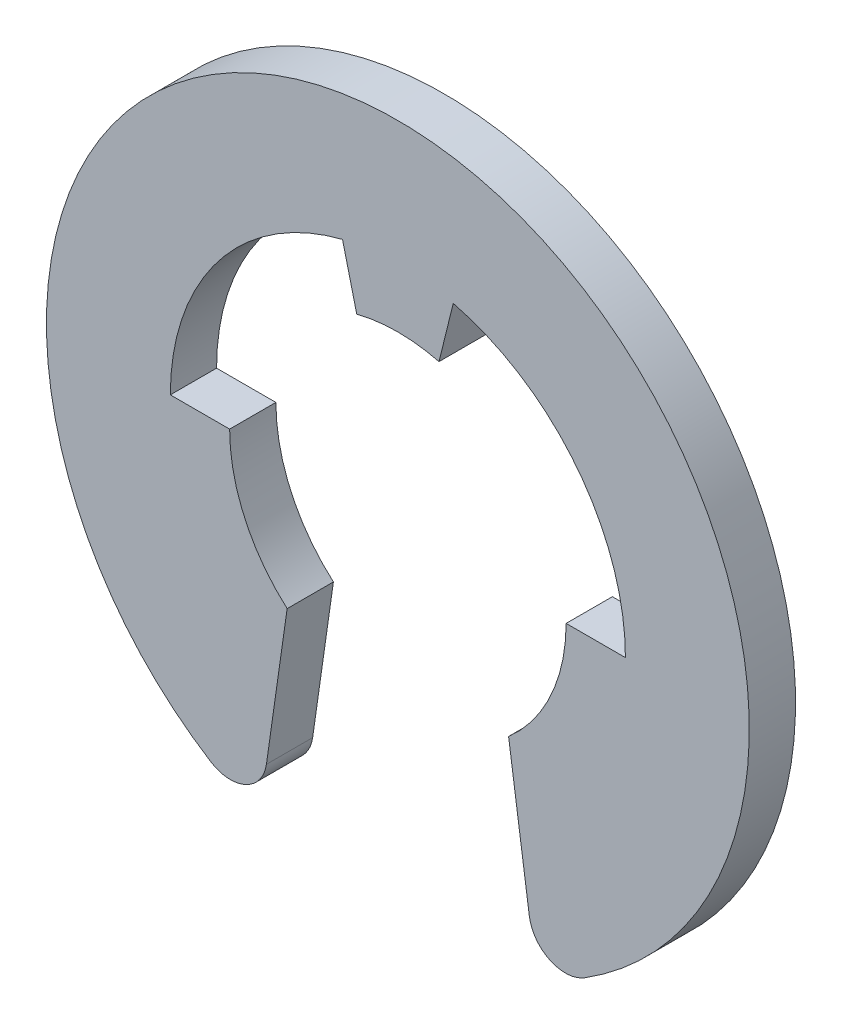
ISO-10303-21;
HEADER;
FILE_DESCRIPTION(('STEP AP214'),'2;1');
FILE_NAME('part.step','',(''),(''),'','','');
FILE_SCHEMA(('AUTOMOTIVE_DESIGN { 1 0 10303 214 1 1 1 1 }'));
ENDSEC;
DATA;
#1=APPLICATION_CONTEXT('core data for automotive mechanical design processes');
#2=APPLICATION_PROTOCOL_DEFINITION('international standard','automotive_design',2000,#1);
#3=PRODUCT_CONTEXT('',#1,'mechanical');
#4=PRODUCT('Part','Part','',(#3));
#5=PRODUCT_RELATED_PRODUCT_CATEGORY('part','',(#4));
#6=PRODUCT_DEFINITION_FORMATION('','',#4);
#7=PRODUCT_DEFINITION_CONTEXT('part definition',#1,'design');
#8=PRODUCT_DEFINITION('design','',#6,#7);
#9=PRODUCT_DEFINITION_SHAPE('','',#8);
#10=(LENGTH_UNIT() NAMED_UNIT(*) SI_UNIT(.MILLI.,.METRE.));
#11=(NAMED_UNIT(*) PLANE_ANGLE_UNIT() SI_UNIT($,.RADIAN.));
#12=(NAMED_UNIT(*) SI_UNIT($,.STERADIAN.) SOLID_ANGLE_UNIT());
#13=UNCERTAINTY_MEASURE_WITH_UNIT(LENGTH_MEASURE(1.E-05),#10,'distance_accuracy_value','');
#14=(GEOMETRIC_REPRESENTATION_CONTEXT(3) GLOBAL_UNCERTAINTY_ASSIGNED_CONTEXT((#13)) GLOBAL_UNIT_ASSIGNED_CONTEXT((#10,
#11,#12)) REPRESENTATION_CONTEXT('',''));
#15=CARTESIAN_POINT('',(0.,0.,0.));
#16=DIRECTION('',(0.,0.,1.));
#17=DIRECTION('',(1.,0.,0.));
#18=AXIS2_PLACEMENT_3D('',#15,#16,#17);
#19=CARTESIAN_POINT('',(0.,0.,0.3175));
#20=DIRECTION('',(0.,0.,-1.));
#21=DIRECTION('',(-1.,0.,0.));
#22=AXIS2_PLACEMENT_3D('',#19,#20,#21);
#23=CYLINDRICAL_SURFACE('',#22,2.31);
#24=CARTESIAN_POINT('',(0.,0.,-0.3175));
#25=DIRECTION('',(0.,0.,-1.));
#26=DIRECTION('',(-1.,0.,0.));
#27=AXIS2_PLACEMENT_3D('',#24,#25,#26);
#28=CIRCLE('',#27,2.31);
#29=CARTESIAN_POINT('',(2.31,0.,-0.3175));
#30=VERTEX_POINT('',#29);
#31=CARTESIAN_POINT('',(1.52,-1.73945393730331,-0.3175));
#32=VERTEX_POINT('',#31);
#33=EDGE_CURVE('E164',#30,#32,#28,.T.);
#34=ORIENTED_EDGE('',*,*,#33,.T.);
#35=DIRECTION('',(0.,0.,-1.));
#36=VECTOR('',#35,1.);
#37=CARTESIAN_POINT('',(1.52,-1.73945393730331,0.3175));
#38=LINE('',#37,#36);
#39=CARTESIAN_POINT('',(1.52,-1.73945393730331,0.3175));
#40=VERTEX_POINT('',#39);
#41=EDGE_CURVE('E11',#40,#32,#38,.T.);
#42=ORIENTED_EDGE('',*,*,#41,.F.);
#43=CARTESIAN_POINT('',(0.,0.,0.3175));
#44=DIRECTION('',(0.,0.,-1.));
#45=DIRECTION('',(-1.,0.,0.));
#46=AXIS2_PLACEMENT_3D('',#43,#44,#45);
#47=CIRCLE('',#46,2.31);
#48=CARTESIAN_POINT('',(2.31,0.,0.3175));
#49=VERTEX_POINT('',#48);
#50=EDGE_CURVE('E190',#49,#40,#47,.T.);
#51=ORIENTED_EDGE('',*,*,#50,.F.);
#52=DIRECTION('',(0.,0.,-1.));
#53=VECTOR('',#52,1.);
#54=CARTESIAN_POINT('',(2.31,0.,0.3175));
#55=LINE('',#54,#53);
#56=EDGE_CURVE('E160',#49,#30,#55,.T.);
#57=ORIENTED_EDGE('',*,*,#56,.T.);
#58=EDGE_LOOP('',(#34,#42,#51,#57));
#59=FACE_BOUND('',#58,.T.);
#60=ADVANCED_FACE('F32',(#59),#23,.F.);
#61=CARTESIAN_POINT('',(1.52,-1.73945393730331,0.3175));
#62=DIRECTION('',(0.989938895863177,0.141495520979269,0.));
#63=DIRECTION('',(-0.141495520979269,0.989938895863177,0.));
#64=AXIS2_PLACEMENT_3D('',#61,#62,#63);
#65=PLANE('',#64);
#66=DIRECTION('',(0.141495520979269,-0.989938895863176,0.));
#67=VECTOR('',#66,1.);
#68=CARTESIAN_POINT('',(1.52,-1.73945393730331,-0.3175));
#69=LINE('',#68,#67);
#70=CARTESIAN_POINT('',(1.805015039701,-3.73349213549719,-0.3175));
#71=VERTEX_POINT('',#70);
#72=EDGE_CURVE('E167',#32,#71,#69,.T.);
#73=ORIENTED_EDGE('',*,*,#72,.T.);
#74=DIRECTION('',(0.,0.,-1.));
#75=VECTOR('',#74,1.);
#76=CARTESIAN_POINT('',(1.805015039701,-3.73349213549719,0.3175));
#77=LINE('',#76,#75);
#78=CARTESIAN_POINT('',(1.805015039701,-3.73349213549719,0.3175));
#79=VERTEX_POINT('',#78);
#80=EDGE_CURVE('E40',#79,#71,#77,.T.);
#81=ORIENTED_EDGE('',*,*,#80,.F.);
#82=DIRECTION('',(0.141495520979269,-0.989938895863176,0.));
#83=VECTOR('',#82,1.);
#84=CARTESIAN_POINT('',(1.52,-1.73945393730331,0.3175));
#85=LINE('',#84,#83);
#86=EDGE_CURVE('E109',#40,#79,#85,.T.);
#87=ORIENTED_EDGE('',*,*,#86,.F.);
#88=ORIENTED_EDGE('',*,*,#41,.T.);
#89=EDGE_LOOP('',(#73,#81,#87,#88));
#90=FACE_BOUND('',#89,.T.);
#91=ADVANCED_FACE('F278',(#90),#65,.F.);
#92=CARTESIAN_POINT('',(2.29998448763259,-3.66274437500755,0.3175));
#93=DIRECTION('',(0.,0.,-1.));
#94=DIRECTION('',(-1.,0.,0.));
#95=AXIS2_PLACEMENT_3D('',#92,#93,#94);
#96=CYLINDRICAL_SURFACE('',#95,0.5);
#97=CARTESIAN_POINT('',(2.29998448763259,-3.66274437500755,-0.3175));
#98=DIRECTION('',(0.,0.,1.));
#99=DIRECTION('',(1.,0.,0.));
#100=AXIS2_PLACEMENT_3D('',#97,#98,#99);
#101=CIRCLE('',#100,0.5);
#102=CARTESIAN_POINT('',(2.56587864805254,-4.08618303107779,-0.3175));
#103=VERTEX_POINT('',#102);
#104=EDGE_CURVE('E169',#71,#103,#101,.T.);
#105=ORIENTED_EDGE('',*,*,#104,.T.);
#106=DIRECTION('',(0.,0.,-1.));
#107=VECTOR('',#106,1.);
#108=CARTESIAN_POINT('',(2.56587864805254,-4.08618303107779,0.3175));
#109=LINE('',#108,#107);
#110=CARTESIAN_POINT('',(2.56587864805254,-4.08618303107779,0.3175));
#111=VERTEX_POINT('',#110);
#112=EDGE_CURVE('E215',#111,#103,#109,.T.);
#113=ORIENTED_EDGE('',*,*,#112,.F.);
#114=CARTESIAN_POINT('',(2.29998448763259,-3.66274437500755,0.3175));
#115=DIRECTION('',(0.,0.,1.));
#116=DIRECTION('',(1.,0.,0.));
#117=AXIS2_PLACEMENT_3D('',#114,#115,#116);
#118=CIRCLE('',#117,0.5);
#119=EDGE_CURVE('E223',#79,#111,#118,.T.);
#120=ORIENTED_EDGE('',*,*,#119,.F.);
#121=ORIENTED_EDGE('',*,*,#80,.T.);
#122=EDGE_LOOP('',(#105,#113,#120,#121));
#123=FACE_BOUND('',#122,.T.);
#124=ADVANCED_FACE('F221',(#123),#96,.T.);
#125=CARTESIAN_POINT('',(0.,0.,0.3175));
#126=DIRECTION('',(0.,0.,-1.));
#127=DIRECTION('',(-1.,0.,0.));
#128=AXIS2_PLACEMENT_3D('',#125,#126,#127);
#129=CYLINDRICAL_SURFACE('',#128,4.825);
#130=CARTESIAN_POINT('',(0.,0.,-0.3175));
#131=DIRECTION('',(0.,0.,1.));
#132=DIRECTION('',(1.,0.,0.));
#133=AXIS2_PLACEMENT_3D('',#130,#131,#132);
#134=CIRCLE('',#133,4.825);
#135=CARTESIAN_POINT('',(-2.56587864805254,-4.08618303107779,-0.3175));
#136=VERTEX_POINT('',#135);
#137=EDGE_CURVE('E171',#103,#136,#134,.T.);
#138=ORIENTED_EDGE('',*,*,#137,.T.);
#139=DIRECTION('',(0.,0.,-1.));
#140=VECTOR('',#139,1.);
#141=CARTESIAN_POINT('',(-2.56587864805254,-4.08618303107779,0.3175));
#142=LINE('',#141,#140);
#143=CARTESIAN_POINT('',(-2.56587864805254,-4.08618303107779,0.3175));
#144=VERTEX_POINT('',#143);
#145=EDGE_CURVE('E212',#144,#136,#142,.T.);
#146=ORIENTED_EDGE('',*,*,#145,.F.);
#147=CARTESIAN_POINT('',(0.,0.,0.3175));
#148=DIRECTION('',(0.,0.,1.));
#149=DIRECTION('',(1.,0.,0.));
#150=AXIS2_PLACEMENT_3D('',#147,#148,#149);
#151=CIRCLE('',#150,4.825);
#152=EDGE_CURVE('E241',#111,#144,#151,.T.);
#153=ORIENTED_EDGE('',*,*,#152,.F.);
#154=ORIENTED_EDGE('',*,*,#112,.T.);
#155=EDGE_LOOP('',(#138,#146,#153,#154));
#156=FACE_BOUND('',#155,.T.);
#157=ADVANCED_FACE('F232',(#156),#129,.T.);
#158=CARTESIAN_POINT('',(-2.29998448763259,-3.66274437500755,0.3175));
#159=DIRECTION('',(0.,0.,-1.));
#160=DIRECTION('',(-1.,0.,0.));
#161=AXIS2_PLACEMENT_3D('',#158,#159,#160);
#162=CYLINDRICAL_SURFACE('',#161,0.5);
#163=CARTESIAN_POINT('',(-2.29998448763259,-3.66274437500755,-0.3175));
#164=DIRECTION('',(0.,0.,1.));
#165=DIRECTION('',(-1.,0.,0.));
#166=AXIS2_PLACEMENT_3D('',#163,#164,#165);
#167=CIRCLE('',#166,0.5);
#168=CARTESIAN_POINT('',(-1.805015039701,-3.73349213549719,-0.3175));
#169=VERTEX_POINT('',#168);
#170=EDGE_CURVE('E173',#136,#169,#167,.T.);
#171=ORIENTED_EDGE('',*,*,#170,.T.);
#172=DIRECTION('',(0.,0.,-1.));
#173=VECTOR('',#172,1.);
#174=CARTESIAN_POINT('',(-1.805015039701,-3.73349213549719,0.3175));
#175=LINE('',#174,#173);
#176=CARTESIAN_POINT('',(-1.805015039701,-3.73349213549719,0.3175));
#177=VERTEX_POINT('',#176);
#178=EDGE_CURVE('E209',#177,#169,#175,.T.);
#179=ORIENTED_EDGE('',*,*,#178,.F.);
#180=CARTESIAN_POINT('',(-2.29998448763259,-3.66274437500755,0.3175));
#181=DIRECTION('',(0.,0.,1.));
#182=DIRECTION('',(-1.,0.,0.));
#183=AXIS2_PLACEMENT_3D('',#180,#181,#182);
#184=CIRCLE('',#183,0.5);
#185=EDGE_CURVE('E238',#144,#177,#184,.T.);
#186=ORIENTED_EDGE('',*,*,#185,.F.);
#187=ORIENTED_EDGE('',*,*,#145,.T.);
#188=EDGE_LOOP('',(#171,#179,#186,#187));
#189=FACE_BOUND('',#188,.T.);
#190=ADVANCED_FACE('F236',(#189),#162,.T.);
#191=CARTESIAN_POINT('',(-1.52,-1.73945393730331,0.3175));
#192=DIRECTION('',(-0.989938895863177,0.141495520979269,0.));
#193=DIRECTION('',(-0.141495520979269,-0.989938895863177,0.));
#194=AXIS2_PLACEMENT_3D('',#191,#192,#193);
#195=PLANE('',#194);
#196=DIRECTION('',(0.141495520979269,0.989938895863177,0.));
#197=VECTOR('',#196,1.);
#198=CARTESIAN_POINT('',(-1.52,-1.73945393730331,-0.3175));
#199=LINE('',#198,#197);
#200=CARTESIAN_POINT('',(-1.52,-1.73945393730331,-0.3175));
#201=VERTEX_POINT('',#200);
#202=EDGE_CURVE('E175',#169,#201,#199,.T.);
#203=ORIENTED_EDGE('',*,*,#202,.T.);
#204=DIRECTION('',(0.,0.,-1.));
#205=VECTOR('',#204,1.);
#206=CARTESIAN_POINT('',(-1.52,-1.73945393730331,0.3175));
#207=LINE('',#206,#205);
#208=CARTESIAN_POINT('',(-1.52,-1.73945393730331,0.3175));
#209=VERTEX_POINT('',#208);
#210=EDGE_CURVE('E206',#209,#201,#207,.T.);
#211=ORIENTED_EDGE('',*,*,#210,.F.);
#212=DIRECTION('',(0.141495520979269,0.989938895863177,0.));
#213=VECTOR('',#212,1.);
#214=CARTESIAN_POINT('',(-1.52,-1.73945393730331,0.3175));
#215=LINE('',#214,#213);
#216=EDGE_CURVE('E240',#177,#209,#215,.T.);
#217=ORIENTED_EDGE('',*,*,#216,.F.);
#218=ORIENTED_EDGE('',*,*,#178,.T.);
#219=EDGE_LOOP('',(#203,#211,#217,#218));
#220=FACE_BOUND('',#219,.T.);
#221=ADVANCED_FACE('F291',(#220),#195,.F.);
#222=CARTESIAN_POINT('',(0.,0.,0.3175));
#223=DIRECTION('',(0.,0.,-1.));
#224=DIRECTION('',(-1.,0.,0.));
#225=AXIS2_PLACEMENT_3D('',#222,#223,#224);
#226=CYLINDRICAL_SURFACE('',#225,2.31);
#227=CARTESIAN_POINT('',(0.,0.,-0.3175));
#228=DIRECTION('',(0.,0.,-1.));
#229=DIRECTION('',(1.,0.,0.));
#230=AXIS2_PLACEMENT_3D('',#227,#228,#229);
#231=CIRCLE('',#230,2.31);
#232=CARTESIAN_POINT('',(-2.31,0.,-0.3175));
#233=VERTEX_POINT('',#232);
#234=EDGE_CURVE('E177',#201,#233,#231,.T.);
#235=ORIENTED_EDGE('',*,*,#234,.T.);
#236=DIRECTION('',(0.,0.,-1.));
#237=VECTOR('',#236,1.);
#238=CARTESIAN_POINT('',(-2.31,0.,0.3175));
#239=LINE('',#238,#237);
#240=CARTESIAN_POINT('',(-2.31,0.,0.3175));
#241=VERTEX_POINT('',#240);
#242=EDGE_CURVE('E203',#241,#233,#239,.T.);
#243=ORIENTED_EDGE('',*,*,#242,.F.);
#244=CARTESIAN_POINT('',(0.,0.,0.3175));
#245=DIRECTION('',(0.,0.,-1.));
#246=DIRECTION('',(1.,0.,0.));
#247=AXIS2_PLACEMENT_3D('',#244,#245,#246);
#248=CIRCLE('',#247,2.31);
#249=EDGE_CURVE('E243',#209,#241,#248,.T.);
#250=ORIENTED_EDGE('',*,*,#249,.F.);
#251=ORIENTED_EDGE('',*,*,#210,.T.);
#252=EDGE_LOOP('',(#235,#243,#250,#251));
#253=FACE_BOUND('',#252,.T.);
#254=ADVANCED_FACE('F294',(#253),#226,.F.);
#255=CARTESIAN_POINT('',(-2.31,0.,0.3175));
#256=DIRECTION('',(0.,-1.,0.));
#257=DIRECTION('',(1.,0.,0.));
#258=AXIS2_PLACEMENT_3D('',#255,#256,#257);
#259=PLANE('',#258);
#260=DIRECTION('',(-1.,0.,0.));
#261=VECTOR('',#260,1.);
#262=CARTESIAN_POINT('',(-2.31,0.,-0.3175));
#263=LINE('',#262,#261);
#264=CARTESIAN_POINT('',(-3.12416071200616,0.,-0.3175));
#265=VERTEX_POINT('',#264);
#266=EDGE_CURVE('E179',#233,#265,#263,.T.);
#267=ORIENTED_EDGE('',*,*,#266,.T.);
#268=DIRECTION('',(0.,0.,-1.));
#269=VECTOR('',#268,1.);
#270=CARTESIAN_POINT('',(-3.12416071200616,0.,0.3175));
#271=LINE('',#270,#269);
#272=CARTESIAN_POINT('',(-3.12416071200616,0.,0.3175));
#273=VERTEX_POINT('',#272);
#274=EDGE_CURVE('E200',#273,#265,#271,.T.);
#275=ORIENTED_EDGE('',*,*,#274,.F.);
#276=DIRECTION('',(-1.,0.,0.));
#277=VECTOR('',#276,1.);
#278=CARTESIAN_POINT('',(-2.31,0.,0.3175));
#279=LINE('',#278,#277);
#280=EDGE_CURVE('E249',#241,#273,#279,.T.);
#281=ORIENTED_EDGE('',*,*,#280,.F.);
#282=ORIENTED_EDGE('',*,*,#242,.T.);
#283=EDGE_LOOP('',(#267,#275,#281,#282));
#284=FACE_BOUND('',#283,.T.);
#285=ADVANCED_FACE('F298',(#284),#259,.F.);
#286=CARTESIAN_POINT('',(0.,0.,0.3175));
#287=DIRECTION('',(0.,0.,-1.));
#288=DIRECTION('',(-1.,0.,0.));
#289=AXIS2_PLACEMENT_3D('',#286,#287,#288);
#290=CYLINDRICAL_SURFACE('',#289,3.12416071200616);
#291=CARTESIAN_POINT('',(0.,0.,-0.3175));
#292=DIRECTION('',(0.,0.,-1.));
#293=DIRECTION('',(1.,0.,0.));
#294=AXIS2_PLACEMENT_3D('',#291,#292,#293);
#295=CIRCLE('',#294,3.12416071200616);
#296=CARTESIAN_POINT('',(-0.76,3.030310240626,-0.3175));
#297=VERTEX_POINT('',#296);
#298=EDGE_CURVE('E181',#265,#297,#295,.T.);
#299=ORIENTED_EDGE('',*,*,#298,.T.);
#300=DIRECTION('',(0.,0.,-1.));
#301=VECTOR('',#300,1.);
#302=CARTESIAN_POINT('',(-0.76,3.030310240626,0.3175));
#303=LINE('',#302,#301);
#304=CARTESIAN_POINT('',(-0.76,3.030310240626,0.3175));
#305=VERTEX_POINT('',#304);
#306=EDGE_CURVE('E197',#305,#297,#303,.T.);
#307=ORIENTED_EDGE('',*,*,#306,.F.);
#308=CARTESIAN_POINT('',(0.,0.,0.3175));
#309=DIRECTION('',(0.,0.,-1.));
#310=DIRECTION('',(1.,0.,0.));
#311=AXIS2_PLACEMENT_3D('',#308,#309,#310);
#312=CIRCLE('',#311,3.12416071200616);
#313=EDGE_CURVE('E251',#273,#305,#312,.T.);
#314=ORIENTED_EDGE('',*,*,#313,.F.);
#315=ORIENTED_EDGE('',*,*,#274,.T.);
#316=EDGE_LOOP('',(#299,#307,#314,#315));
#317=FACE_BOUND('',#316,.T.);
#318=ADVANCED_FACE('F302',(#317),#290,.F.);
#319=CARTESIAN_POINT('',(-0.565,2.23983816379666,0.3175));
#320=DIRECTION('',(0.970894384834788,0.239508023866171,0.));
#321=DIRECTION('',(-0.239508023866171,0.970894384834788,0.));
#322=AXIS2_PLACEMENT_3D('',#319,#320,#321);
#323=PLANE('',#322);
#324=DIRECTION('',(0.239508023866171,-0.970894384834788,0.));
#325=VECTOR('',#324,1.);
#326=CARTESIAN_POINT('',(-0.565,2.23983816379666,-0.3175));
#327=LINE('',#326,#325);
#328=CARTESIAN_POINT('',(-0.565,2.23983816379666,-0.3175));
#329=VERTEX_POINT('',#328);
#330=EDGE_CURVE('E183',#297,#329,#327,.T.);
#331=ORIENTED_EDGE('',*,*,#330,.T.);
#332=DIRECTION('',(0.,0.,-1.));
#333=VECTOR('',#332,1.);
#334=CARTESIAN_POINT('',(-0.565,2.23983816379666,0.3175));
#335=LINE('',#334,#333);
#336=CARTESIAN_POINT('',(-0.565,2.23983816379666,0.3175));
#337=VERTEX_POINT('',#336);
#338=EDGE_CURVE('E194',#337,#329,#335,.T.);
#339=ORIENTED_EDGE('',*,*,#338,.F.);
#340=DIRECTION('',(0.239508023866171,-0.970894384834788,0.));
#341=VECTOR('',#340,1.);
#342=CARTESIAN_POINT('',(-0.565,2.23983816379666,0.3175));
#343=LINE('',#342,#341);
#344=EDGE_CURVE('E253',#305,#337,#343,.T.);
#345=ORIENTED_EDGE('',*,*,#344,.F.);
#346=ORIENTED_EDGE('',*,*,#306,.T.);
#347=EDGE_LOOP('',(#331,#339,#345,#346));
#348=FACE_BOUND('',#347,.T.);
#349=ADVANCED_FACE('F259',(#348),#323,.F.);
#350=CARTESIAN_POINT('',(0.,0.,0.3175));
#351=DIRECTION('',(0.,0.,-1.));
#352=DIRECTION('',(-1.,0.,0.));
#353=AXIS2_PLACEMENT_3D('',#350,#351,#352);
#354=CYLINDRICAL_SURFACE('',#353,2.31);
#355=CARTESIAN_POINT('',(0.,0.,-0.3175));
#356=DIRECTION('',(0.,0.,-1.));
#357=DIRECTION('',(1.,0.,0.));
#358=AXIS2_PLACEMENT_3D('',#355,#356,#357);
#359=CIRCLE('',#358,2.31);
#360=CARTESIAN_POINT('',(0.565000000000001,2.23983816379666,-0.3175));
#361=VERTEX_POINT('',#360);
#362=EDGE_CURVE('E185',#329,#361,#359,.T.);
#363=ORIENTED_EDGE('',*,*,#362,.T.);
#364=DIRECTION('',(0.,0.,-1.));
#365=VECTOR('',#364,1.);
#366=CARTESIAN_POINT('',(0.565000000000001,2.23983816379666,0.3175));
#367=LINE('',#366,#365);
#368=CARTESIAN_POINT('',(0.565000000000001,2.23983816379666,0.3175));
#369=VERTEX_POINT('',#368);
#370=EDGE_CURVE('E155',#369,#361,#367,.T.);
#371=ORIENTED_EDGE('',*,*,#370,.F.);
#372=CARTESIAN_POINT('',(0.,0.,0.3175));
#373=DIRECTION('',(0.,0.,-1.));
#374=DIRECTION('',(1.,0.,0.));
#375=AXIS2_PLACEMENT_3D('',#372,#373,#374);
#376=CIRCLE('',#375,2.31);
#377=EDGE_CURVE('E146',#337,#369,#376,.T.);
#378=ORIENTED_EDGE('',*,*,#377,.F.);
#379=ORIENTED_EDGE('',*,*,#338,.T.);
#380=EDGE_LOOP('',(#363,#371,#378,#379));
#381=FACE_BOUND('',#380,.T.);
#382=ADVANCED_FACE('F263',(#381),#354,.F.);
#383=CARTESIAN_POINT('',(0.565,2.23983816379666,0.3175));
#384=DIRECTION('',(-0.970894384834788,0.239508023866171,0.));
#385=DIRECTION('',(-0.239508023866171,-0.970894384834788,0.));
#386=AXIS2_PLACEMENT_3D('',#383,#384,#385);
#387=PLANE('',#386);
#388=DIRECTION('',(0.239508023866171,0.970894384834788,0.));
#389=VECTOR('',#388,1.);
#390=CARTESIAN_POINT('',(0.565,2.23983816379666,-0.3175));
#391=LINE('',#390,#389);
#392=CARTESIAN_POINT('',(0.76,3.030310240626,-0.3175));
#393=VERTEX_POINT('',#392);
#394=EDGE_CURVE('E154',#361,#393,#391,.T.);
#395=ORIENTED_EDGE('',*,*,#394,.T.);
#396=DIRECTION('',(0.,0.,-1.));
#397=VECTOR('',#396,1.);
#398=CARTESIAN_POINT('',(0.76,3.030310240626,0.3175));
#399=LINE('',#398,#397);
#400=CARTESIAN_POINT('',(0.76,3.030310240626,0.3175));
#401=VERTEX_POINT('',#400);
#402=EDGE_CURVE('E151',#401,#393,#399,.T.);
#403=ORIENTED_EDGE('',*,*,#402,.F.);
#404=DIRECTION('',(0.239508023866171,0.970894384834788,0.));
#405=VECTOR('',#404,1.);
#406=CARTESIAN_POINT('',(0.565,2.23983816379666,0.3175));
#407=LINE('',#406,#405);
#408=EDGE_CURVE('E140',#369,#401,#407,.T.);
#409=ORIENTED_EDGE('',*,*,#408,.F.);
#410=ORIENTED_EDGE('',*,*,#370,.T.);
#411=EDGE_LOOP('',(#395,#403,#409,#410));
#412=FACE_BOUND('',#411,.T.);
#413=ADVANCED_FACE('F152',(#412),#387,.F.);
#414=CARTESIAN_POINT('',(0.,0.,0.3175));
#415=DIRECTION('',(0.,0.,-1.));
#416=DIRECTION('',(-1.,0.,0.));
#417=AXIS2_PLACEMENT_3D('',#414,#415,#416);
#418=CYLINDRICAL_SURFACE('',#417,3.12416071200616);
#419=CARTESIAN_POINT('',(0.,0.,-0.3175));
#420=DIRECTION('',(0.,0.,-1.));
#421=DIRECTION('',(-1.,0.,0.));
#422=AXIS2_PLACEMENT_3D('',#419,#420,#421);
#423=CIRCLE('',#422,3.12416071200616);
#424=CARTESIAN_POINT('',(3.12416071200616,0.,-0.3175));
#425=VERTEX_POINT('',#424);
#426=EDGE_CURVE('E95',#393,#425,#423,.T.);
#427=ORIENTED_EDGE('',*,*,#426,.T.);
#428=DIRECTION('',(0.,0.,-1.));
#429=VECTOR('',#428,1.);
#430=CARTESIAN_POINT('',(3.12416071200616,0.,0.3175));
#431=LINE('',#430,#429);
#432=CARTESIAN_POINT('',(3.12416071200616,0.,0.3175));
#433=VERTEX_POINT('',#432);
#434=EDGE_CURVE('E156',#433,#425,#431,.T.);
#435=ORIENTED_EDGE('',*,*,#434,.F.);
#436=CARTESIAN_POINT('',(0.,0.,0.3175));
#437=DIRECTION('',(0.,0.,-1.));
#438=DIRECTION('',(-1.,0.,0.));
#439=AXIS2_PLACEMENT_3D('',#436,#437,#438);
#440=CIRCLE('',#439,3.12416071200616);
#441=EDGE_CURVE('E144',#401,#433,#440,.T.);
#442=ORIENTED_EDGE('',*,*,#441,.F.);
#443=ORIENTED_EDGE('',*,*,#402,.T.);
#444=EDGE_LOOP('',(#427,#435,#442,#443));
#445=FACE_BOUND('',#444,.T.);
#446=ADVANCED_FACE('F158',(#445),#418,.F.);
#447=CARTESIAN_POINT('',(2.31,0.,0.3175));
#448=DIRECTION('',(0.,-1.,0.));
#449=DIRECTION('',(1.,0.,0.));
#450=AXIS2_PLACEMENT_3D('',#447,#448,#449);
#451=PLANE('',#450);
#452=DIRECTION('',(-1.,0.,0.));
#453=VECTOR('',#452,1.);
#454=CARTESIAN_POINT('',(2.31,0.,-0.3175));
#455=LINE('',#454,#453);
#456=EDGE_CURVE('E101',#425,#30,#455,.T.);
#457=ORIENTED_EDGE('',*,*,#456,.T.);
#458=ORIENTED_EDGE('',*,*,#56,.F.);
#459=DIRECTION('',(-1.,0.,0.));
#460=VECTOR('',#459,1.);
#461=CARTESIAN_POINT('',(2.31,0.,0.3175));
#462=LINE('',#461,#460);
#463=EDGE_CURVE('E48',#433,#49,#462,.T.);
#464=ORIENTED_EDGE('',*,*,#463,.F.);
#465=ORIENTED_EDGE('',*,*,#434,.T.);
#466=EDGE_LOOP('',(#457,#458,#464,#465));
#467=FACE_BOUND('',#466,.T.);
#468=ADVANCED_FACE('F267',(#467),#451,.F.);
#469=CARTESIAN_POINT('',(0.,0.,0.3175));
#470=DIRECTION('',(0.,0.,-1.));
#471=DIRECTION('',(-1.,0.,0.));
#472=AXIS2_PLACEMENT_3D('',#469,#470,#471);
#473=PLANE('',#472);
#474=ORIENTED_EDGE('',*,*,#50,.T.);
#475=ORIENTED_EDGE('',*,*,#86,.T.);
#476=ORIENTED_EDGE('',*,*,#119,.T.);
#477=ORIENTED_EDGE('',*,*,#152,.T.);
#478=ORIENTED_EDGE('',*,*,#185,.T.);
#479=ORIENTED_EDGE('',*,*,#216,.T.);
#480=ORIENTED_EDGE('',*,*,#249,.T.);
#481=ORIENTED_EDGE('',*,*,#280,.T.);
#482=ORIENTED_EDGE('',*,*,#313,.T.);
#483=ORIENTED_EDGE('',*,*,#344,.T.);
#484=ORIENTED_EDGE('',*,*,#377,.T.);
#485=ORIENTED_EDGE('',*,*,#408,.T.);
#486=ORIENTED_EDGE('',*,*,#441,.T.);
#487=ORIENTED_EDGE('',*,*,#463,.T.);
#488=EDGE_LOOP('',(#474,#475,#476,#477,#478,#479,#480,#481,#482,#483,#484,#485,#486,#487));
#489=FACE_BOUND('',#488,.T.);
#490=ADVANCED_FACE('F142',(#489),#473,.F.);
#491=CARTESIAN_POINT('',(0.,0.,-0.3175));
#492=DIRECTION('',(0.,0.,-1.));
#493=DIRECTION('',(-1.,0.,0.));
#494=AXIS2_PLACEMENT_3D('',#491,#492,#493);
#495=PLANE('',#494);
#496=ORIENTED_EDGE('',*,*,#33,.F.);
#497=ORIENTED_EDGE('',*,*,#456,.F.);
#498=ORIENTED_EDGE('',*,*,#426,.F.);
#499=ORIENTED_EDGE('',*,*,#394,.F.);
#500=ORIENTED_EDGE('',*,*,#362,.F.);
#501=ORIENTED_EDGE('',*,*,#330,.F.);
#502=ORIENTED_EDGE('',*,*,#298,.F.);
#503=ORIENTED_EDGE('',*,*,#266,.F.);
#504=ORIENTED_EDGE('',*,*,#234,.F.);
#505=ORIENTED_EDGE('',*,*,#202,.F.);
#506=ORIENTED_EDGE('',*,*,#170,.F.);
#507=ORIENTED_EDGE('',*,*,#137,.F.);
#508=ORIENTED_EDGE('',*,*,#104,.F.);
#509=ORIENTED_EDGE('',*,*,#72,.F.);
#510=EDGE_LOOP('',(#496,#497,#498,#499,#500,#501,#502,#503,#504,#505,#506,#507,#508,#509));
#511=FACE_BOUND('',#510,.T.);
#512=ADVANCED_FACE('F227',(#511),#495,.T.);
#513=CLOSED_SHELL('',(#60,#91,#124,#157,#190,#221,#254,#285,#318,#349,#382,#413,#446,#468,#490,#512));
#514=MANIFOLD_SOLID_BREP('B2',#513);
#515=ADVANCED_BREP_SHAPE_REPRESENTATION('',(#18,#514),#14);
#516=SHAPE_DEFINITION_REPRESENTATION(#9,#515);
ENDSEC;
END-ISO-10303-21;
